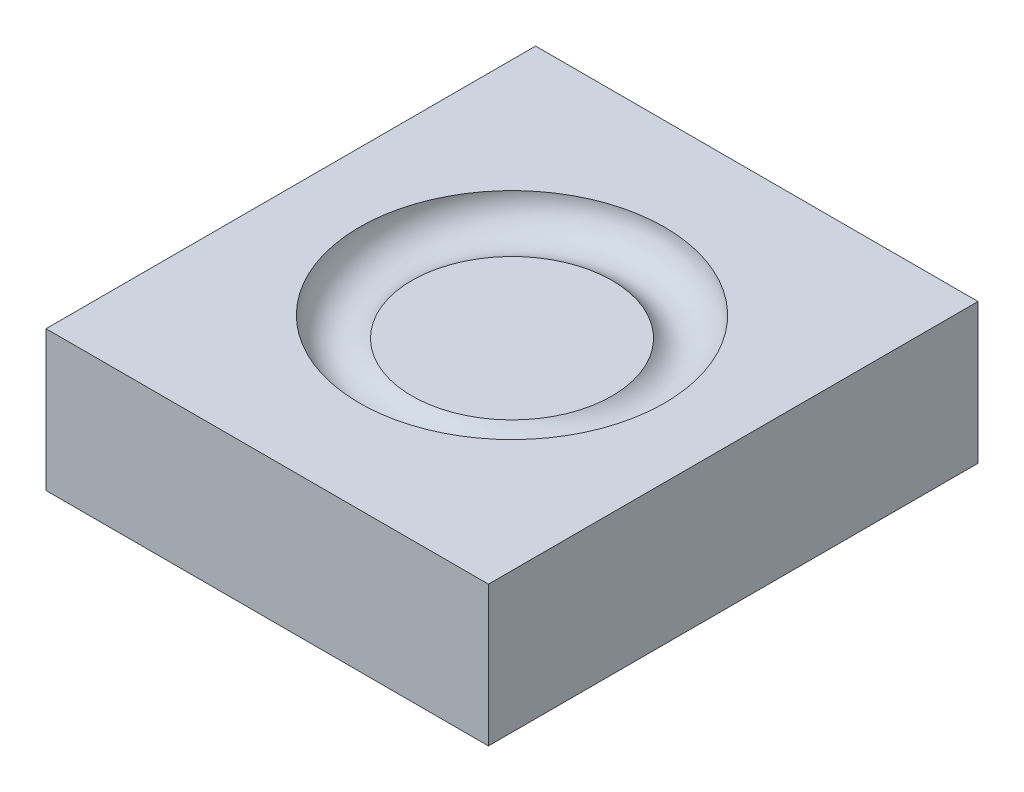
ISO-10303-21;
HEADER;
FILE_DESCRIPTION(('STEP AP214'),'2;1');
FILE_NAME('part.step','',(''),(''),'','','');
FILE_SCHEMA(('AUTOMOTIVE_DESIGN { 1 0 10303 214 1 1 1 1 }'));
ENDSEC;
DATA;
#1=APPLICATION_CONTEXT('core data for automotive mechanical design processes');
#2=APPLICATION_PROTOCOL_DEFINITION('international standard','automotive_design',2000,#1);
#3=PRODUCT_CONTEXT('',#1,'mechanical');
#4=PRODUCT('Part','Part','',(#3));
#5=PRODUCT_RELATED_PRODUCT_CATEGORY('part','',(#4));
#6=PRODUCT_DEFINITION_FORMATION('','',#4);
#7=PRODUCT_DEFINITION_CONTEXT('part definition',#1,'design');
#8=PRODUCT_DEFINITION('design','',#6,#7);
#9=PRODUCT_DEFINITION_SHAPE('','',#8);
#10=(LENGTH_UNIT() NAMED_UNIT(*) SI_UNIT(.MILLI.,.METRE.));
#11=(NAMED_UNIT(*) PLANE_ANGLE_UNIT() SI_UNIT($,.RADIAN.));
#12=(NAMED_UNIT(*) SI_UNIT($,.STERADIAN.) SOLID_ANGLE_UNIT());
#13=UNCERTAINTY_MEASURE_WITH_UNIT(LENGTH_MEASURE(1.E-05),#10,'distance_accuracy_value','');
#14=(GEOMETRIC_REPRESENTATION_CONTEXT(3) GLOBAL_UNCERTAINTY_ASSIGNED_CONTEXT((#13)) GLOBAL_UNIT_ASSIGNED_CONTEXT((#10,
#11,#12)) REPRESENTATION_CONTEXT('',''));
#15=CARTESIAN_POINT('',(0.,0.,0.));
#16=DIRECTION('',(0.,0.,1.));
#17=DIRECTION('',(1.,0.,0.));
#18=AXIS2_PLACEMENT_3D('',#15,#16,#17);
#19=CARTESIAN_POINT('',(0.,-60.,0.));
#20=DIRECTION('',(0.,-1.,0.));
#21=DIRECTION('',(0.,0.,-1.));
#22=AXIS2_PLACEMENT_3D('',#19,#20,#21);
#23=PLANE('',#22);
#24=DIRECTION('',(0.,0.,1.));
#25=VECTOR('',#24,1.);
#26=CARTESIAN_POINT('',(110.509484608928,-60.,122.290495949038));
#27=LINE('',#26,#25);
#28=CARTESIAN_POINT('',(110.509484608928,-60.,-122.290495949038));
#29=VERTEX_POINT('',#28);
#30=CARTESIAN_POINT('',(110.509484608928,-60.,122.290495949038));
#31=VERTEX_POINT('',#30);
#32=EDGE_CURVE('E85',#29,#31,#27,.T.);
#33=ORIENTED_EDGE('',*,*,#32,.T.);
#34=DIRECTION('',(-1.,0.,0.));
#35=VECTOR('',#34,1.);
#36=CARTESIAN_POINT('',(-110.509484608928,-60.,122.290495949038));
#37=LINE('',#36,#35);
#38=CARTESIAN_POINT('',(-110.509484608928,-60.,122.290495949038));
#39=VERTEX_POINT('',#38);
#40=EDGE_CURVE('E92',#31,#39,#37,.T.);
#41=ORIENTED_EDGE('',*,*,#40,.T.);
#42=DIRECTION('',(0.,0.,-1.));
#43=VECTOR('',#42,1.);
#44=CARTESIAN_POINT('',(-110.509484608928,-60.,122.290495949038));
#45=LINE('',#44,#43);
#46=CARTESIAN_POINT('',(-110.509484608928,-60.,-122.290495949038));
#47=VERTEX_POINT('',#46);
#48=EDGE_CURVE('E98',#39,#47,#45,.T.);
#49=ORIENTED_EDGE('',*,*,#48,.T.);
#50=DIRECTION('',(1.,0.,0.));
#51=VECTOR('',#50,1.);
#52=CARTESIAN_POINT('',(-110.509484608928,-60.,-122.290495949038));
#53=LINE('',#52,#51);
#54=EDGE_CURVE('E90',#47,#29,#53,.T.);
#55=ORIENTED_EDGE('',*,*,#54,.T.);
#56=EDGE_LOOP('',(#33,#41,#49,#55));
#57=FACE_BOUND('',#56,.T.);
#58=ADVANCED_FACE('F39',(#57),#23,.T.);
#59=CARTESIAN_POINT('',(-110.509484608928,80.,122.290495949038));
#60=DIRECTION('',(0.,0.,1.));
#61=DIRECTION('',(1.,0.,0.));
#62=AXIS2_PLACEMENT_3D('',#59,#60,#61);
#63=PLANE('',#62);
#64=DIRECTION('',(0.,-1.,0.));
#65=VECTOR('',#64,1.);
#66=CARTESIAN_POINT('',(110.509484608928,80.,122.290495949038));
#67=LINE('',#66,#65);
#68=CARTESIAN_POINT('',(110.509484608928,9.99999999999998,122.290495949038));
#69=VERTEX_POINT('',#68);
#70=EDGE_CURVE('E81',#69,#31,#67,.T.);
#71=ORIENTED_EDGE('',*,*,#70,.F.);
#72=DIRECTION('',(-1.,0.,0.));
#73=VECTOR('',#72,1.);
#74=CARTESIAN_POINT('',(-110.509484608928,9.99999999999998,122.290495949038));
#75=LINE('',#74,#73);
#76=CARTESIAN_POINT('',(-110.509484608928,9.99999999999998,122.290495949038));
#77=VERTEX_POINT('',#76);
#78=EDGE_CURVE('E43',#69,#77,#75,.T.);
#79=ORIENTED_EDGE('',*,*,#78,.T.);
#80=DIRECTION('',(0.,-1.,0.));
#81=VECTOR('',#80,1.);
#82=CARTESIAN_POINT('',(-110.509484608928,80.,122.290495949038));
#83=LINE('',#82,#81);
#84=EDGE_CURVE('E89',#77,#39,#83,.T.);
#85=ORIENTED_EDGE('',*,*,#84,.T.);
#86=ORIENTED_EDGE('',*,*,#40,.F.);
#87=EDGE_LOOP('',(#71,#79,#85,#86));
#88=FACE_BOUND('',#87,.T.);
#89=ADVANCED_FACE('F93',(#88),#63,.T.);
#90=CARTESIAN_POINT('',(-110.509484608928,80.,122.290495949038));
#91=DIRECTION('',(-1.,0.,0.));
#92=DIRECTION('',(0.,0.,1.));
#93=AXIS2_PLACEMENT_3D('',#90,#91,#92);
#94=PLANE('',#93);
#95=ORIENTED_EDGE('',*,*,#84,.F.);
#96=DIRECTION('',(0.,0.,-1.));
#97=VECTOR('',#96,1.);
#98=CARTESIAN_POINT('',(-110.509484608928,9.99999999999998,122.290495949038));
#99=LINE('',#98,#97);
#100=CARTESIAN_POINT('',(-110.509484608928,10.,-122.290495949038));
#101=VERTEX_POINT('',#100);
#102=EDGE_CURVE('E114',#77,#101,#99,.T.);
#103=ORIENTED_EDGE('',*,*,#102,.T.);
#104=DIRECTION('',(0.,-1.,0.));
#105=VECTOR('',#104,1.);
#106=CARTESIAN_POINT('',(-110.509484608928,80.,-122.290495949038));
#107=LINE('',#106,#105);
#108=EDGE_CURVE('E109',#101,#47,#107,.T.);
#109=ORIENTED_EDGE('',*,*,#108,.T.);
#110=ORIENTED_EDGE('',*,*,#48,.F.);
#111=EDGE_LOOP('',(#95,#103,#109,#110));
#112=FACE_BOUND('',#111,.T.);
#113=ADVANCED_FACE('F113',(#112),#94,.T.);
#114=CARTESIAN_POINT('',(-110.509484608928,80.,-122.290495949038));
#115=DIRECTION('',(0.,0.,-1.));
#116=DIRECTION('',(-1.,0.,0.));
#117=AXIS2_PLACEMENT_3D('',#114,#115,#116);
#118=PLANE('',#117);
#119=ORIENTED_EDGE('',*,*,#108,.F.);
#120=DIRECTION('',(1.,0.,0.));
#121=VECTOR('',#120,1.);
#122=CARTESIAN_POINT('',(-110.509484608928,9.99999999999999,-122.290495949038));
#123=LINE('',#122,#121);
#124=CARTESIAN_POINT('',(110.509484608928,9.99999999999999,-122.290495949038));
#125=VERTEX_POINT('',#124);
#126=EDGE_CURVE('E61',#101,#125,#123,.T.);
#127=ORIENTED_EDGE('',*,*,#126,.T.);
#128=DIRECTION('',(0.,-1.,0.));
#129=VECTOR('',#128,1.);
#130=CARTESIAN_POINT('',(110.509484608928,80.,-122.290495949038));
#131=LINE('',#130,#129);
#132=EDGE_CURVE('E107',#125,#29,#131,.T.);
#133=ORIENTED_EDGE('',*,*,#132,.T.);
#134=ORIENTED_EDGE('',*,*,#54,.F.);
#135=EDGE_LOOP('',(#119,#127,#133,#134));
#136=FACE_BOUND('',#135,.T.);
#137=ADVANCED_FACE('F116',(#136),#118,.T.);
#138=CARTESIAN_POINT('',(110.509484608928,80.,122.290495949038));
#139=DIRECTION('',(1.,0.,0.));
#140=DIRECTION('',(0.,0.,-1.));
#141=AXIS2_PLACEMENT_3D('',#138,#139,#140);
#142=PLANE('',#141);
#143=ORIENTED_EDGE('',*,*,#132,.F.);
#144=DIRECTION('',(0.,0.,1.));
#145=VECTOR('',#144,1.);
#146=CARTESIAN_POINT('',(110.509484608928,9.99999999999998,122.290495949038));
#147=LINE('',#146,#145);
#148=EDGE_CURVE('E87',#125,#69,#147,.T.);
#149=ORIENTED_EDGE('',*,*,#148,.T.);
#150=ORIENTED_EDGE('',*,*,#70,.T.);
#151=ORIENTED_EDGE('',*,*,#32,.F.);
#152=EDGE_LOOP('',(#143,#149,#150,#151));
#153=FACE_BOUND('',#152,.T.);
#154=ADVANCED_FACE('F41',(#153),#142,.T.);
#155=CARTESIAN_POINT('',(0.,0.,0.));
#156=DIRECTION('',(0.,-1.,0.));
#157=DIRECTION('',(0.,0.,-1.));
#158=AXIS2_PLACEMENT_3D('',#155,#156,#157);
#159=PLANE('',#158);
#160=CARTESIAN_POINT('',(0.,0.,0.));
#161=DIRECTION('',(0.,-1.,0.));
#162=DIRECTION('',(0.,0.,-1.));
#163=AXIS2_PLACEMENT_3D('',#160,#161,#162);
#164=CIRCLE('',#163,50.);
#165=CARTESIAN_POINT('',(0.,0.,-50.));
#166=VERTEX_POINT('',#165);
#167=EDGE_CURVE('E49',#166,#166,#164,.T.);
#168=ORIENTED_EDGE('',*,*,#167,.F.);
#169=EDGE_LOOP('',(#168));
#170=FACE_BOUND('',#169,.T.);
#171=ADVANCED_FACE('F127',(#170),#159,.F.);
#172=CARTESIAN_POINT('',(0.,10.,0.));
#173=DIRECTION('',(0.,-1.,0.));
#174=DIRECTION('',(0.,0.,-1.));
#175=AXIS2_PLACEMENT_3D('',#172,#173,#174);
#176=TOROIDAL_SURFACE('',#175,61.180339887499,15.);
#177=ORIENTED_EDGE('',*,*,#167,.T.);
#178=EDGE_LOOP('',(#177));
#179=FACE_BOUND('',#178,.T.);
#180=CARTESIAN_POINT('',(0.,10.,0.));
#181=DIRECTION('',(0.,-1.,0.));
#182=DIRECTION('',(0.,0.,-1.));
#183=AXIS2_PLACEMENT_3D('',#180,#181,#182);
#184=CIRCLE('',#183,76.1803398874989);
#185=CARTESIAN_POINT('',(0.,10.,-76.1803398874989));
#186=VERTEX_POINT('',#185);
#187=EDGE_CURVE('E11',#186,#186,#184,.T.);
#188=ORIENTED_EDGE('',*,*,#187,.F.);
#189=EDGE_LOOP('',(#188));
#190=FACE_BOUND('',#189,.T.);
#191=ADVANCED_FACE('F124',(#179,#190),#176,.F.);
#192=CARTESIAN_POINT('',(-1.59378207120077,10.,-76.1803403189587));
#193=DIRECTION('',(0.,1.,0.));
#194=DIRECTION('',(0.999999999999963,0.,2.70714461886545E-07));
#195=AXIS2_PLACEMENT_3D('',#192,#193,#194);
#196=PLANE('',#195);
#197=ORIENTED_EDGE('',*,*,#126,.F.);
#198=ORIENTED_EDGE('',*,*,#102,.F.);
#199=ORIENTED_EDGE('',*,*,#78,.F.);
#200=ORIENTED_EDGE('',*,*,#148,.F.);
#201=EDGE_LOOP('',(#197,#198,#199,#200));
#202=FACE_BOUND('',#201,.T.);
#203=ORIENTED_EDGE('',*,*,#187,.T.);
#204=EDGE_LOOP('',(#203));
#205=FACE_BOUND('',#204,.T.);
#206=ADVANCED_FACE('F134',(#202,#205),#196,.T.);
#207=CLOSED_SHELL('',(#58,#89,#113,#137,#154,#171,#191,#206));
#208=MANIFOLD_SOLID_BREP('B2',#207);
#209=ADVANCED_BREP_SHAPE_REPRESENTATION('',(#18,#208),#14);
#210=SHAPE_DEFINITION_REPRESENTATION(#9,#209);
ENDSEC;
END-ISO-10303-21;
